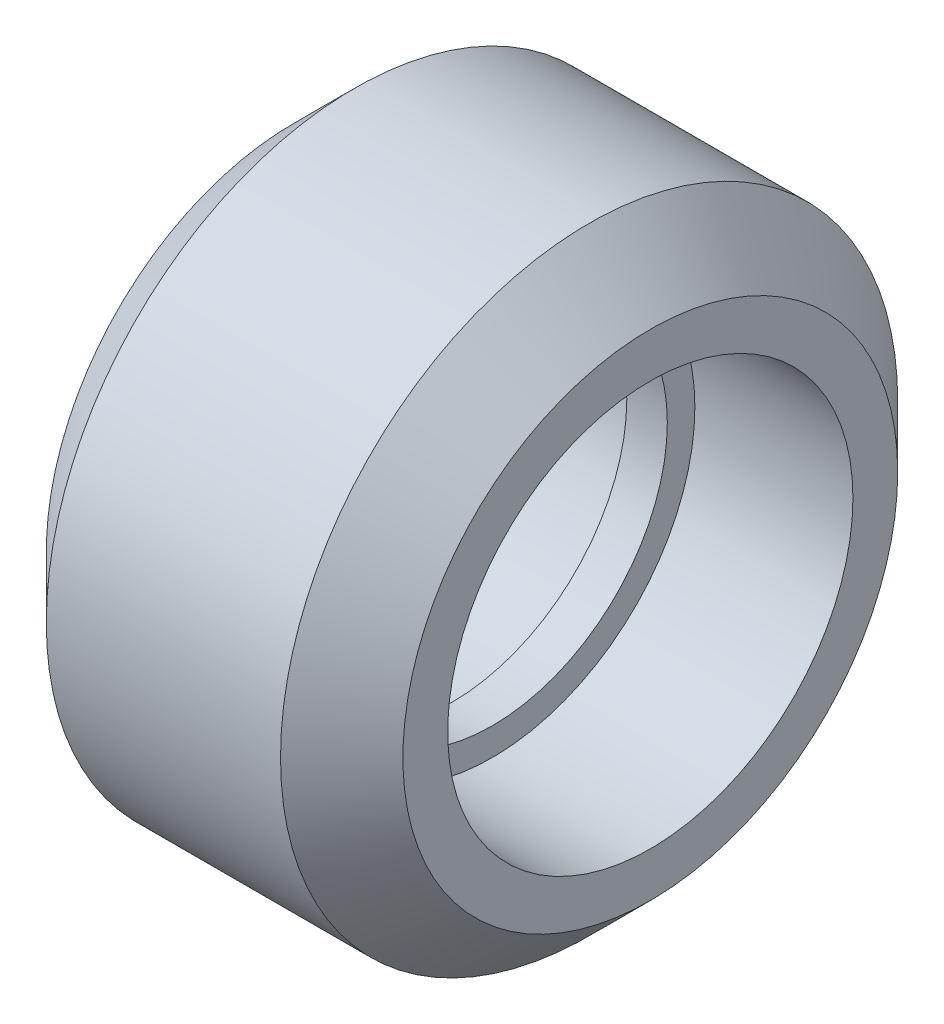
ISO-10303-21;
HEADER;
FILE_DESCRIPTION(('STEP AP214'),'2;1');
FILE_NAME('part.step','',(''),(''),'','','');
FILE_SCHEMA(('AUTOMOTIVE_DESIGN { 1 0 10303 214 1 1 1 1 }'));
ENDSEC;
DATA;
#1=APPLICATION_CONTEXT('core data for automotive mechanical design processes');
#2=APPLICATION_PROTOCOL_DEFINITION('international standard','automotive_design',2000,#1);
#3=PRODUCT_CONTEXT('',#1,'mechanical');
#4=PRODUCT('Part','Part','',(#3));
#5=PRODUCT_RELATED_PRODUCT_CATEGORY('part','',(#4));
#6=PRODUCT_DEFINITION_FORMATION('','',#4);
#7=PRODUCT_DEFINITION_CONTEXT('part definition',#1,'design');
#8=PRODUCT_DEFINITION('design','',#6,#7);
#9=PRODUCT_DEFINITION_SHAPE('','',#8);
#10=(LENGTH_UNIT() NAMED_UNIT(*) SI_UNIT(.MILLI.,.METRE.));
#11=(NAMED_UNIT(*) PLANE_ANGLE_UNIT() SI_UNIT($,.RADIAN.));
#12=(NAMED_UNIT(*) SI_UNIT($,.STERADIAN.) SOLID_ANGLE_UNIT());
#13=UNCERTAINTY_MEASURE_WITH_UNIT(LENGTH_MEASURE(1.E-05),#10,'distance_accuracy_value','');
#14=(GEOMETRIC_REPRESENTATION_CONTEXT(3) GLOBAL_UNCERTAINTY_ASSIGNED_CONTEXT((#13)) GLOBAL_UNIT_ASSIGNED_CONTEXT((#10,
#11,#12)) REPRESENTATION_CONTEXT('',''));
#15=CARTESIAN_POINT('',(0.,0.,0.));
#16=DIRECTION('',(0.,0.,1.));
#17=DIRECTION('',(1.,0.,0.));
#18=AXIS2_PLACEMENT_3D('',#15,#16,#17);
#19=CARTESIAN_POINT('',(-0.5,4.32,0.));
#20=DIRECTION('',(-1.,0.,0.));
#21=DIRECTION('',(0.,0.,1.));
#22=AXIS2_PLACEMENT_3D('',#19,#20,#21);
#23=PLANE('',#22);
#24=CARTESIAN_POINT('',(-0.5,0.,0.));
#25=DIRECTION('',(1.,0.,0.));
#26=DIRECTION('',(0.,0.,-1.));
#27=AXIS2_PLACEMENT_3D('',#24,#25,#26);
#28=CIRCLE('',#27,4.32);
#29=CARTESIAN_POINT('',(-0.5,0.,-4.32));
#30=VERTEX_POINT('',#29);
#31=EDGE_CURVE('E10',#30,#30,#28,.T.);
#32=ORIENTED_EDGE('',*,*,#31,.T.);
#33=EDGE_LOOP('',(#32));
#34=FACE_BOUND('',#33,.T.);
#35=CARTESIAN_POINT('',(-0.5,0.,0.));
#36=DIRECTION('',(1.,0.,0.));
#37=DIRECTION('',(0.,0.,-1.));
#38=AXIS2_PLACEMENT_3D('',#35,#36,#37);
#39=CIRCLE('',#38,5.);
#40=CARTESIAN_POINT('',(-0.5,0.,-5.));
#41=VERTEX_POINT('',#40);
#42=EDGE_CURVE('E73',#41,#41,#39,.T.);
#43=ORIENTED_EDGE('',*,*,#42,.F.);
#44=EDGE_LOOP('',(#43));
#45=FACE_BOUND('',#44,.T.);
#46=ADVANCED_FACE('F34',(#34,#45),#23,.T.);
#47=CARTESIAN_POINT('',(0.,0.,0.));
#48=DIRECTION('',(1.,0.,0.));
#49=DIRECTION('',(0.,0.,-1.));
#50=AXIS2_PLACEMENT_3D('',#47,#48,#49);
#51=CYLINDRICAL_SURFACE('',#50,4.32);
#52=CARTESIAN_POINT('',(0.5,0.,0.));
#53=DIRECTION('',(1.,0.,0.));
#54=DIRECTION('',(0.,0.,-1.));
#55=AXIS2_PLACEMENT_3D('',#52,#53,#54);
#56=CIRCLE('',#55,4.32);
#57=CARTESIAN_POINT('',(0.5,0.,-4.32));
#58=VERTEX_POINT('',#57);
#59=EDGE_CURVE('E40',#58,#58,#56,.T.);
#60=ORIENTED_EDGE('',*,*,#59,.T.);
#61=EDGE_LOOP('',(#60));
#62=FACE_BOUND('',#61,.T.);
#63=ORIENTED_EDGE('',*,*,#31,.F.);
#64=EDGE_LOOP('',(#63));
#65=FACE_BOUND('',#64,.T.);
#66=ADVANCED_FACE('F83',(#62,#65),#51,.F.);
#67=CARTESIAN_POINT('',(0.5,4.32,0.));
#68=DIRECTION('',(1.,0.,0.));
#69=DIRECTION('',(0.,0.,-1.));
#70=AXIS2_PLACEMENT_3D('',#67,#68,#69);
#71=PLANE('',#70);
#72=CARTESIAN_POINT('',(0.5,0.,0.));
#73=DIRECTION('',(1.,0.,0.));
#74=DIRECTION('',(0.,0.,-1.));
#75=AXIS2_PLACEMENT_3D('',#72,#73,#74);
#76=CIRCLE('',#75,5.);
#77=CARTESIAN_POINT('',(0.5,0.,-5.));
#78=VERTEX_POINT('',#77);
#79=EDGE_CURVE('E45',#78,#78,#76,.T.);
#80=ORIENTED_EDGE('',*,*,#79,.T.);
#81=EDGE_LOOP('',(#80));
#82=FACE_BOUND('',#81,.T.);
#83=ORIENTED_EDGE('',*,*,#59,.F.);
#84=EDGE_LOOP('',(#83));
#85=FACE_BOUND('',#84,.T.);
#86=ADVANCED_FACE('F87',(#82,#85),#71,.T.);
#87=CARTESIAN_POINT('',(0.,0.,0.));
#88=DIRECTION('',(1.,0.,0.));
#89=DIRECTION('',(0.,0.,-1.));
#90=AXIS2_PLACEMENT_3D('',#87,#88,#89);
#91=CYLINDRICAL_SURFACE('',#90,5.);
#92=CARTESIAN_POINT('',(4.4,0.,0.));
#93=DIRECTION('',(1.,0.,0.));
#94=DIRECTION('',(0.,0.,-1.));
#95=AXIS2_PLACEMENT_3D('',#92,#93,#94);
#96=CIRCLE('',#95,5.);
#97=CARTESIAN_POINT('',(4.4,0.,-5.));
#98=VERTEX_POINT('',#97);
#99=EDGE_CURVE('E51',#98,#98,#96,.T.);
#100=ORIENTED_EDGE('',*,*,#99,.T.);
#101=EDGE_LOOP('',(#100));
#102=FACE_BOUND('',#101,.T.);
#103=ORIENTED_EDGE('',*,*,#79,.F.);
#104=EDGE_LOOP('',(#103));
#105=FACE_BOUND('',#104,.T.);
#106=ADVANCED_FACE('F91',(#102,#105),#91,.F.);
#107=CARTESIAN_POINT('',(4.4,5.,0.));
#108=DIRECTION('',(1.,0.,0.));
#109=DIRECTION('',(0.,0.,-1.));
#110=AXIS2_PLACEMENT_3D('',#107,#108,#109);
#111=PLANE('',#110);
#112=CARTESIAN_POINT('',(4.4,0.,0.));
#113=DIRECTION('',(1.,0.,0.));
#114=DIRECTION('',(0.,0.,-1.));
#115=AXIS2_PLACEMENT_3D('',#112,#113,#114);
#116=CIRCLE('',#115,6.10500000000001);
#117=CARTESIAN_POINT('',(4.4,0.,-6.10500000000001));
#118=VERTEX_POINT('',#117);
#119=EDGE_CURVE('E56',#118,#118,#116,.T.);
#120=ORIENTED_EDGE('',*,*,#119,.T.);
#121=EDGE_LOOP('',(#120));
#122=FACE_BOUND('',#121,.T.);
#123=ORIENTED_EDGE('',*,*,#99,.F.);
#124=EDGE_LOOP('',(#123));
#125=FACE_BOUND('',#124,.T.);
#126=ADVANCED_FACE('F98',(#122,#125),#111,.T.);
#127=CARTESIAN_POINT('',(4.4,0.,0.));
#128=DIRECTION('',(-1.,0.,0.));
#129=DIRECTION('',(0.,0.,1.));
#130=AXIS2_PLACEMENT_3D('',#127,#128,#129);
#131=CONICAL_SURFACE('',#130,6.10500000000001,0.785398163397447);
#132=CARTESIAN_POINT('',(2.89,0.,0.));
#133=DIRECTION('',(1.,0.,0.));
#134=DIRECTION('',(0.,0.,-1.));
#135=AXIS2_PLACEMENT_3D('',#132,#133,#134);
#136=CIRCLE('',#135,7.615);
#137=CARTESIAN_POINT('',(2.89,0.,-7.615));
#138=VERTEX_POINT('',#137);
#139=EDGE_CURVE('E59',#138,#138,#136,.T.);
#140=ORIENTED_EDGE('',*,*,#139,.T.);
#141=EDGE_LOOP('',(#140));
#142=FACE_BOUND('',#141,.T.);
#143=ORIENTED_EDGE('',*,*,#119,.F.);
#144=EDGE_LOOP('',(#143));
#145=FACE_BOUND('',#144,.T.);
#146=ADVANCED_FACE('F102',(#142,#145),#131,.T.);
#147=CARTESIAN_POINT('',(0.,0.,0.));
#148=DIRECTION('',(1.,0.,0.));
#149=DIRECTION('',(0.,0.,-1.));
#150=AXIS2_PLACEMENT_3D('',#147,#148,#149);
#151=CYLINDRICAL_SURFACE('',#150,7.615);
#152=CARTESIAN_POINT('',(-2.89,0.,0.));
#153=DIRECTION('',(1.,0.,0.));
#154=DIRECTION('',(0.,0.,-1.));
#155=AXIS2_PLACEMENT_3D('',#152,#153,#154);
#156=CIRCLE('',#155,7.615);
#157=CARTESIAN_POINT('',(-2.89,0.,-7.615));
#158=VERTEX_POINT('',#157);
#159=EDGE_CURVE('E62',#158,#158,#156,.T.);
#160=ORIENTED_EDGE('',*,*,#159,.T.);
#161=EDGE_LOOP('',(#160));
#162=FACE_BOUND('',#161,.T.);
#163=ORIENTED_EDGE('',*,*,#139,.F.);
#164=EDGE_LOOP('',(#163));
#165=FACE_BOUND('',#164,.T.);
#166=ADVANCED_FACE('F106',(#162,#165),#151,.T.);
#167=CARTESIAN_POINT('',(-2.89,0.,0.));
#168=DIRECTION('',(1.,0.,0.));
#169=DIRECTION('',(0.,0.,-1.));
#170=AXIS2_PLACEMENT_3D('',#167,#168,#169);
#171=CONICAL_SURFACE('',#170,7.615,0.785398163397447);
#172=CARTESIAN_POINT('',(-4.4,0.,0.));
#173=DIRECTION('',(1.,0.,0.));
#174=DIRECTION('',(0.,0.,-1.));
#175=AXIS2_PLACEMENT_3D('',#172,#173,#174);
#176=CIRCLE('',#175,6.105);
#177=CARTESIAN_POINT('',(-4.4,0.,-6.105));
#178=VERTEX_POINT('',#177);
#179=EDGE_CURVE('E66',#178,#178,#176,.T.);
#180=ORIENTED_EDGE('',*,*,#179,.T.);
#181=EDGE_LOOP('',(#180));
#182=FACE_BOUND('',#181,.T.);
#183=ORIENTED_EDGE('',*,*,#159,.F.);
#184=EDGE_LOOP('',(#183));
#185=FACE_BOUND('',#184,.T.);
#186=ADVANCED_FACE('F110',(#182,#185),#171,.T.);
#187=CARTESIAN_POINT('',(-4.4,5.,0.));
#188=DIRECTION('',(-1.,0.,0.));
#189=DIRECTION('',(0.,0.,1.));
#190=AXIS2_PLACEMENT_3D('',#187,#188,#189);
#191=PLANE('',#190);
#192=CARTESIAN_POINT('',(-4.4,0.,0.));
#193=DIRECTION('',(1.,0.,0.));
#194=DIRECTION('',(0.,0.,-1.));
#195=AXIS2_PLACEMENT_3D('',#192,#193,#194);
#196=CIRCLE('',#195,5.);
#197=CARTESIAN_POINT('',(-4.4,0.,-5.));
#198=VERTEX_POINT('',#197);
#199=EDGE_CURVE('E70',#198,#198,#196,.T.);
#200=ORIENTED_EDGE('',*,*,#199,.T.);
#201=EDGE_LOOP('',(#200));
#202=FACE_BOUND('',#201,.T.);
#203=ORIENTED_EDGE('',*,*,#179,.F.);
#204=EDGE_LOOP('',(#203));
#205=FACE_BOUND('',#204,.T.);
#206=ADVANCED_FACE('F114',(#202,#205),#191,.T.);
#207=CARTESIAN_POINT('',(0.,0.,0.));
#208=DIRECTION('',(1.,0.,0.));
#209=DIRECTION('',(0.,0.,-1.));
#210=AXIS2_PLACEMENT_3D('',#207,#208,#209);
#211=CYLINDRICAL_SURFACE('',#210,5.);
#212=ORIENTED_EDGE('',*,*,#42,.T.);
#213=EDGE_LOOP('',(#212));
#214=FACE_BOUND('',#213,.T.);
#215=ORIENTED_EDGE('',*,*,#199,.F.);
#216=EDGE_LOOP('',(#215));
#217=FACE_BOUND('',#216,.T.);
#218=ADVANCED_FACE('F79',(#214,#217),#211,.F.);
#219=CLOSED_SHELL('',(#46,#66,#86,#106,#126,#146,#166,#186,#206,#218));
#220=MANIFOLD_SOLID_BREP('B2',#219);
#221=ADVANCED_BREP_SHAPE_REPRESENTATION('',(#18,#220),#14);
#222=SHAPE_DEFINITION_REPRESENTATION(#9,#221);
ENDSEC;
END-ISO-10303-21;
